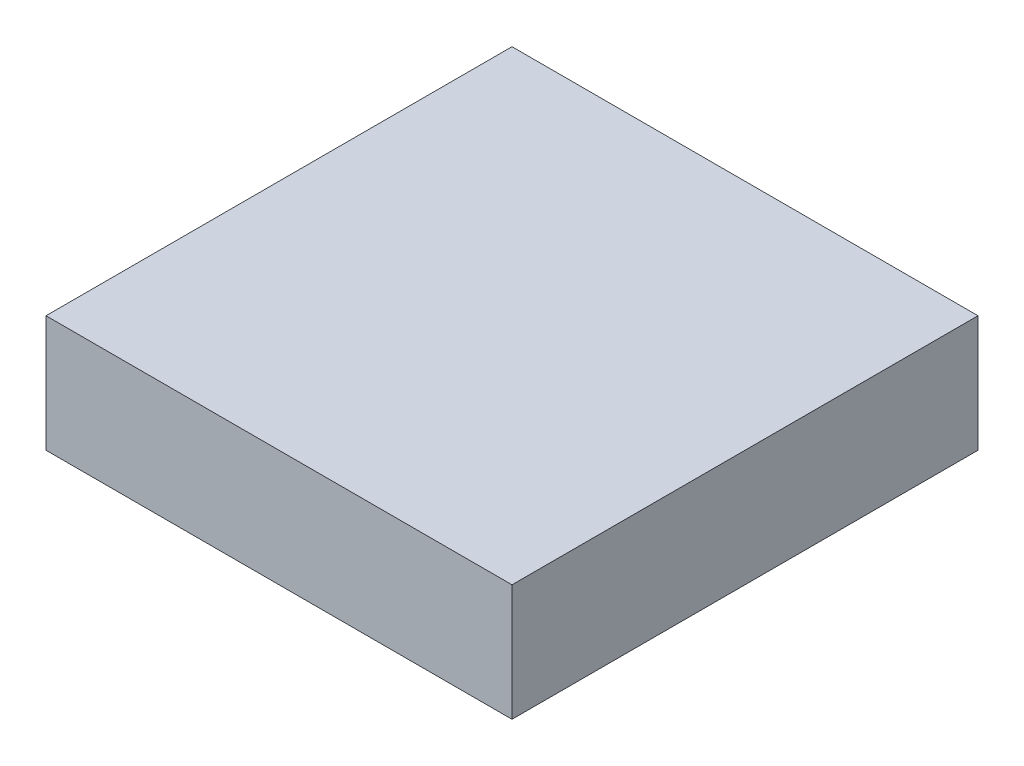
ISO-10303-21;
HEADER;
FILE_DESCRIPTION(('STEP AP214'),'2;1');
FILE_NAME('part.step','',(''),(''),'','','');
FILE_SCHEMA(('AUTOMOTIVE_DESIGN { 1 0 10303 214 1 1 1 1 }'));
ENDSEC;
DATA;
#1=APPLICATION_CONTEXT('core data for automotive mechanical design processes');
#2=APPLICATION_PROTOCOL_DEFINITION('international standard','automotive_design',2000,#1);
#3=PRODUCT_CONTEXT('',#1,'mechanical');
#4=PRODUCT('Part','Part','',(#3));
#5=PRODUCT_RELATED_PRODUCT_CATEGORY('part','',(#4));
#6=PRODUCT_DEFINITION_FORMATION('','',#4);
#7=PRODUCT_DEFINITION_CONTEXT('part definition',#1,'design');
#8=PRODUCT_DEFINITION('design','',#6,#7);
#9=PRODUCT_DEFINITION_SHAPE('','',#8);
#10=(LENGTH_UNIT() NAMED_UNIT(*) SI_UNIT(.MILLI.,.METRE.));
#11=(NAMED_UNIT(*) PLANE_ANGLE_UNIT() SI_UNIT($,.RADIAN.));
#12=(NAMED_UNIT(*) SI_UNIT($,.STERADIAN.) SOLID_ANGLE_UNIT());
#13=UNCERTAINTY_MEASURE_WITH_UNIT(LENGTH_MEASURE(1.E-05),#10,'distance_accuracy_value','');
#14=(GEOMETRIC_REPRESENTATION_CONTEXT(3) GLOBAL_UNCERTAINTY_ASSIGNED_CONTEXT((#13)) GLOBAL_UNIT_ASSIGNED_CONTEXT((#10,
#11,#12)) REPRESENTATION_CONTEXT('',''));
#15=CARTESIAN_POINT('',(0.,0.,0.));
#16=DIRECTION('',(0.,0.,1.));
#17=DIRECTION('',(1.,0.,0.));
#18=AXIS2_PLACEMENT_3D('',#15,#16,#17);
#19=CARTESIAN_POINT('',(-505.459999999999,57.15,1013.46));
#20=DIRECTION('',(0.,0.,-1.));
#21=DIRECTION('',(1.,0.,0.));
#22=AXIS2_PLACEMENT_3D('',#19,#20,#21);
#23=PLANE('',#22);
#24=DIRECTION('',(1.,0.,0.));
#25=VECTOR('',#24,1.);
#26=CARTESIAN_POINT('',(-505.459999999999,76.2,1013.46));
#27=LINE('',#26,#25);
#28=CARTESIAN_POINT('',(-505.459999999999,76.2,1013.46));
#29=VERTEX_POINT('',#28);
#30=CARTESIAN_POINT('',(-429.259999999999,76.2,1013.46));
#31=VERTEX_POINT('',#30);
#32=EDGE_CURVE('E101',#29,#31,#27,.T.);
#33=ORIENTED_EDGE('',*,*,#32,.F.);
#34=DIRECTION('',(0.,1.,0.));
#35=VECTOR('',#34,1.);
#36=CARTESIAN_POINT('',(-505.459999999999,57.15,1013.46));
#37=LINE('',#36,#35);
#38=CARTESIAN_POINT('',(-505.459999999999,57.15,1013.46));
#39=VERTEX_POINT('',#38);
#40=EDGE_CURVE('E100',#39,#29,#37,.T.);
#41=ORIENTED_EDGE('',*,*,#40,.F.);
#42=DIRECTION('',(1.,0.,0.));
#43=VECTOR('',#42,1.);
#44=CARTESIAN_POINT('',(-505.459999999999,57.15,1013.46));
#45=LINE('',#44,#43);
#46=CARTESIAN_POINT('',(-429.259999999999,57.15,1013.46));
#47=VERTEX_POINT('',#46);
#48=EDGE_CURVE('E95',#39,#47,#45,.T.);
#49=ORIENTED_EDGE('',*,*,#48,.T.);
#50=DIRECTION('',(0.,1.,0.));
#51=VECTOR('',#50,1.);
#52=CARTESIAN_POINT('',(-429.259999999999,57.15,1013.46));
#53=LINE('',#52,#51);
#54=EDGE_CURVE('E11',#47,#31,#53,.T.);
#55=ORIENTED_EDGE('',*,*,#54,.T.);
#56=EDGE_LOOP('',(#33,#41,#49,#55));
#57=FACE_BOUND('',#56,.T.);
#58=ADVANCED_FACE('F38',(#57),#23,.F.);
#59=CARTESIAN_POINT('',(-429.26,57.15,937.26));
#60=DIRECTION('',(-1.,0.,0.));
#61=DIRECTION('',(0.,0.,-1.));
#62=AXIS2_PLACEMENT_3D('',#59,#60,#61);
#63=PLANE('',#62);
#64=DIRECTION('',(0.,0.,-1.));
#65=VECTOR('',#64,1.);
#66=CARTESIAN_POINT('',(-429.26,76.2,937.26));
#67=LINE('',#66,#65);
#68=CARTESIAN_POINT('',(-429.26,76.2,937.26));
#69=VERTEX_POINT('',#68);
#70=EDGE_CURVE('E103',#31,#69,#67,.T.);
#71=ORIENTED_EDGE('',*,*,#70,.F.);
#72=ORIENTED_EDGE('',*,*,#54,.F.);
#73=DIRECTION('',(0.,0.,-1.));
#74=VECTOR('',#73,1.);
#75=CARTESIAN_POINT('',(-429.259999999999,57.15,1013.46));
#76=LINE('',#75,#74);
#77=CARTESIAN_POINT('',(-429.26,57.15,937.26));
#78=VERTEX_POINT('',#77);
#79=EDGE_CURVE('E79',#47,#78,#76,.T.);
#80=ORIENTED_EDGE('',*,*,#79,.T.);
#81=DIRECTION('',(0.,1.,0.));
#82=VECTOR('',#81,1.);
#83=CARTESIAN_POINT('',(-429.26,57.15,937.26));
#84=LINE('',#83,#82);
#85=EDGE_CURVE('E46',#78,#69,#84,.T.);
#86=ORIENTED_EDGE('',*,*,#85,.T.);
#87=EDGE_LOOP('',(#71,#72,#80,#86));
#88=FACE_BOUND('',#87,.T.);
#89=ADVANCED_FACE('F93',(#88),#63,.F.);
#90=CARTESIAN_POINT('',(-505.459999999999,57.15,937.26));
#91=DIRECTION('',(0.,0.,1.));
#92=DIRECTION('',(-1.,0.,0.));
#93=AXIS2_PLACEMENT_3D('',#90,#91,#92);
#94=PLANE('',#93);
#95=DIRECTION('',(-1.,0.,0.));
#96=VECTOR('',#95,1.);
#97=CARTESIAN_POINT('',(-505.459999999999,76.2,937.26));
#98=LINE('',#97,#96);
#99=CARTESIAN_POINT('',(-505.459999999999,76.2,937.26));
#100=VERTEX_POINT('',#99);
#101=EDGE_CURVE('E89',#69,#100,#98,.T.);
#102=ORIENTED_EDGE('',*,*,#101,.F.);
#103=ORIENTED_EDGE('',*,*,#85,.F.);
#104=DIRECTION('',(-1.,0.,0.));
#105=VECTOR('',#104,1.);
#106=CARTESIAN_POINT('',(-429.26,57.15,937.26));
#107=LINE('',#106,#105);
#108=CARTESIAN_POINT('',(-505.459999999999,57.15,937.26));
#109=VERTEX_POINT('',#108);
#110=EDGE_CURVE('E82',#78,#109,#107,.T.);
#111=ORIENTED_EDGE('',*,*,#110,.T.);
#112=DIRECTION('',(0.,1.,0.));
#113=VECTOR('',#112,1.);
#114=CARTESIAN_POINT('',(-505.459999999999,57.15,937.26));
#115=LINE('',#114,#113);
#116=EDGE_CURVE('E92',#109,#100,#115,.T.);
#117=ORIENTED_EDGE('',*,*,#116,.T.);
#118=EDGE_LOOP('',(#102,#103,#111,#117));
#119=FACE_BOUND('',#118,.T.);
#120=ADVANCED_FACE('F88',(#119),#94,.F.);
#121=CARTESIAN_POINT('',(-505.459999999999,57.15,1013.46));
#122=DIRECTION('',(1.,0.,0.));
#123=DIRECTION('',(0.,0.,1.));
#124=AXIS2_PLACEMENT_3D('',#121,#122,#123);
#125=PLANE('',#124);
#126=DIRECTION('',(0.,0.,1.));
#127=VECTOR('',#126,1.);
#128=CARTESIAN_POINT('',(-505.459999999999,76.2,1013.46));
#129=LINE('',#128,#127);
#130=EDGE_CURVE('E68',#100,#29,#129,.T.);
#131=ORIENTED_EDGE('',*,*,#130,.F.);
#132=ORIENTED_EDGE('',*,*,#116,.F.);
#133=DIRECTION('',(0.,0.,1.));
#134=VECTOR('',#133,1.);
#135=CARTESIAN_POINT('',(-505.459999999999,57.15,1013.46));
#136=LINE('',#135,#134);
#137=EDGE_CURVE('E54',#109,#39,#136,.T.);
#138=ORIENTED_EDGE('',*,*,#137,.T.);
#139=ORIENTED_EDGE('',*,*,#40,.T.);
#140=EDGE_LOOP('',(#131,#132,#138,#139));
#141=FACE_BOUND('',#140,.T.);
#142=ADVANCED_FACE('F112',(#141),#125,.F.);
#143=CARTESIAN_POINT('',(0.,57.15,0.));
#144=DIRECTION('',(0.,-1.,0.));
#145=DIRECTION('',(0.,0.,-1.));
#146=AXIS2_PLACEMENT_3D('',#143,#144,#145);
#147=PLANE('',#146);
#148=ORIENTED_EDGE('',*,*,#48,.F.);
#149=ORIENTED_EDGE('',*,*,#137,.F.);
#150=ORIENTED_EDGE('',*,*,#110,.F.);
#151=ORIENTED_EDGE('',*,*,#79,.F.);
#152=EDGE_LOOP('',(#148,#149,#150,#151));
#153=FACE_BOUND('',#152,.T.);
#154=ADVANCED_FACE('F84',(#153),#147,.T.);
#155=CARTESIAN_POINT('',(0.,76.2,0.));
#156=DIRECTION('',(0.,-1.,0.));
#157=DIRECTION('',(0.,0.,-1.));
#158=AXIS2_PLACEMENT_3D('',#155,#156,#157);
#159=PLANE('',#158);
#160=ORIENTED_EDGE('',*,*,#32,.T.);
#161=ORIENTED_EDGE('',*,*,#70,.T.);
#162=ORIENTED_EDGE('',*,*,#101,.T.);
#163=ORIENTED_EDGE('',*,*,#130,.T.);
#164=EDGE_LOOP('',(#160,#161,#162,#163));
#165=FACE_BOUND('',#164,.T.);
#166=ADVANCED_FACE('F108',(#165),#159,.F.);
#167=CLOSED_SHELL('',(#58,#89,#120,#142,#154,#166));
#168=MANIFOLD_SOLID_BREP('B2',#167);
#169=ADVANCED_BREP_SHAPE_REPRESENTATION('',(#18,#168),#14);
#170=SHAPE_DEFINITION_REPRESENTATION(#9,#169);
ENDSEC;
END-ISO-10303-21;
